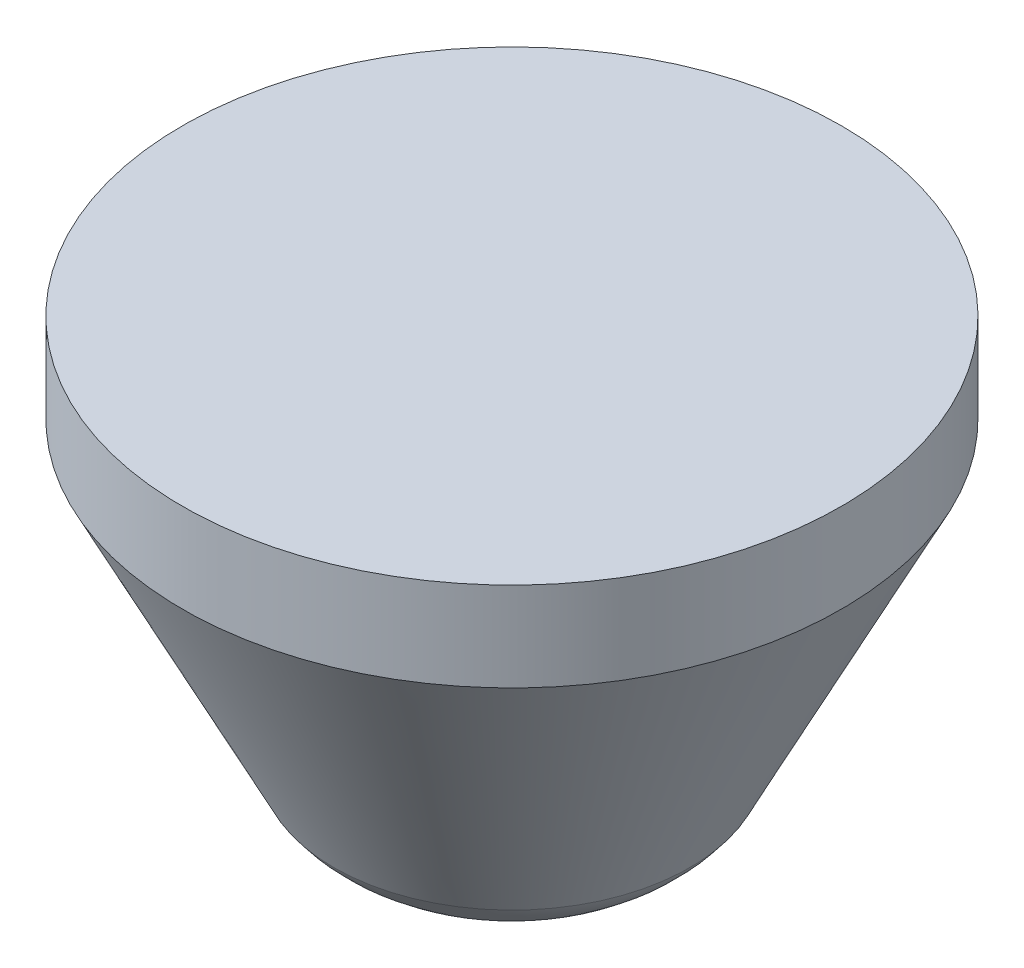
ISO-10303-21;
HEADER;
FILE_DESCRIPTION(('STEP AP214'),'2;1');
FILE_NAME('part.step','',(''),(''),'','','');
FILE_SCHEMA(('AUTOMOTIVE_DESIGN { 1 0 10303 214 1 1 1 1 }'));
ENDSEC;
DATA;
#1=APPLICATION_CONTEXT('core data for automotive mechanical design processes');
#2=APPLICATION_PROTOCOL_DEFINITION('international standard','automotive_design',2000,#1);
#3=PRODUCT_CONTEXT('',#1,'mechanical');
#4=PRODUCT('Part','Part','',(#3));
#5=PRODUCT_RELATED_PRODUCT_CATEGORY('part','',(#4));
#6=PRODUCT_DEFINITION_FORMATION('','',#4);
#7=PRODUCT_DEFINITION_CONTEXT('part definition',#1,'design');
#8=PRODUCT_DEFINITION('design','',#6,#7);
#9=PRODUCT_DEFINITION_SHAPE('','',#8);
#10=(LENGTH_UNIT() NAMED_UNIT(*) SI_UNIT(.MILLI.,.METRE.));
#11=(NAMED_UNIT(*) PLANE_ANGLE_UNIT() SI_UNIT($,.RADIAN.));
#12=(NAMED_UNIT(*) SI_UNIT($,.STERADIAN.) SOLID_ANGLE_UNIT());
#13=UNCERTAINTY_MEASURE_WITH_UNIT(LENGTH_MEASURE(1.E-05),#10,'distance_accuracy_value','');
#14=(GEOMETRIC_REPRESENTATION_CONTEXT(3) GLOBAL_UNCERTAINTY_ASSIGNED_CONTEXT((#13)) GLOBAL_UNIT_ASSIGNED_CONTEXT((#10,
#11,#12)) REPRESENTATION_CONTEXT('',''));
#15=CARTESIAN_POINT('',(0.,0.,0.));
#16=DIRECTION('',(0.,0.,1.));
#17=DIRECTION('',(1.,0.,0.));
#18=AXIS2_PLACEMENT_3D('',#15,#16,#17);
#19=CARTESIAN_POINT('',(1.54331945305403,0.,0.));
#20=DIRECTION('',(0.,-1.,0.));
#21=DIRECTION('',(0.,0.,-1.));
#22=AXIS2_PLACEMENT_3D('',#19,#20,#21);
#23=PLANE('',#22);
#24=CARTESIAN_POINT('',(0.,0.,0.));
#25=DIRECTION('',(0.,-1.,0.));
#26=DIRECTION('',(0.,0.,-1.));
#27=AXIS2_PLACEMENT_3D('',#24,#25,#26);
#28=CIRCLE('',#27,1.54331945305403);
#29=CARTESIAN_POINT('',(0.,0.,-1.54331945305403));
#30=VERTEX_POINT('',#29);
#31=EDGE_CURVE('E49',#30,#30,#28,.T.);
#32=ORIENTED_EDGE('',*,*,#31,.T.);
#33=EDGE_LOOP('',(#32));
#34=FACE_BOUND('',#33,.T.);
#35=ADVANCED_FACE('F35',(#34),#23,.T.);
#36=CARTESIAN_POINT('',(0.,10.,0.));
#37=DIRECTION('',(0.,1.,0.));
#38=DIRECTION('',(0.,0.,1.));
#39=AXIS2_PLACEMENT_3D('',#36,#37,#38);
#40=PLANE('',#39);
#41=CARTESIAN_POINT('',(0.,10.,0.));
#42=DIRECTION('',(0.,-1.,0.));
#43=DIRECTION('',(0.,0.,-1.));
#44=AXIS2_PLACEMENT_3D('',#41,#42,#43);
#45=CIRCLE('',#44,7.4);
#46=CARTESIAN_POINT('',(0.,10.,-7.4));
#47=VERTEX_POINT('',#46);
#48=EDGE_CURVE('E10',#47,#47,#45,.T.);
#49=ORIENTED_EDGE('',*,*,#48,.F.);
#50=EDGE_LOOP('',(#49));
#51=FACE_BOUND('',#50,.T.);
#52=ADVANCED_FACE('F67',(#51),#40,.T.);
#53=CARTESIAN_POINT('',(0.,0.,0.));
#54=DIRECTION('',(0.,-1.,0.));
#55=DIRECTION('',(0.,0.,-1.));
#56=AXIS2_PLACEMENT_3D('',#53,#54,#55);
#57=CYLINDRICAL_SURFACE('',#56,7.4);
#58=ORIENTED_EDGE('',*,*,#48,.T.);
#59=EDGE_LOOP('',(#58));
#60=FACE_BOUND('',#59,.T.);
#61=CARTESIAN_POINT('',(0.,8.,0.));
#62=DIRECTION('',(0.,-1.,0.));
#63=DIRECTION('',(0.,0.,-1.));
#64=AXIS2_PLACEMENT_3D('',#61,#62,#63);
#65=CIRCLE('',#64,7.4);
#66=CARTESIAN_POINT('',(0.,8.,-7.4));
#67=VERTEX_POINT('',#66);
#68=EDGE_CURVE('E41',#67,#67,#65,.T.);
#69=ORIENTED_EDGE('',*,*,#68,.F.);
#70=EDGE_LOOP('',(#69));
#71=FACE_BOUND('',#70,.T.);
#72=ADVANCED_FACE('F64',(#60,#71),#57,.T.);
#73=CARTESIAN_POINT('',(0.,1.27330944701672,0.));
#74=DIRECTION('',(0.,1.,0.));
#75=DIRECTION('',(0.,0.,1.));
#76=AXIS2_PLACEMENT_3D('',#73,#74,#75);
#77=CONICAL_SURFACE('',#76,3.99659068433652,0.468401033160418);
#78=ORIENTED_EDGE('',*,*,#68,.T.);
#79=EDGE_LOOP('',(#78));
#80=FACE_BOUND('',#79,.T.);
#81=CARTESIAN_POINT('',(0.,1.27330944701672,0.));
#82=DIRECTION('',(0.,-1.,0.));
#83=DIRECTION('',(0.,0.,-1.));
#84=AXIS2_PLACEMENT_3D('',#81,#82,#83);
#85=CIRCLE('',#84,3.99659068433652);
#86=CARTESIAN_POINT('',(0.,1.27330944701672,-3.99659068433652));
#87=VERTEX_POINT('',#86);
#88=EDGE_CURVE('E45',#87,#87,#85,.T.);
#89=ORIENTED_EDGE('',*,*,#88,.F.);
#90=EDGE_LOOP('',(#89));
#91=FACE_BOUND('',#90,.T.);
#92=ADVANCED_FACE('F58',(#80,#91),#77,.T.);
#93=CARTESIAN_POINT('',(0.,3.,0.));
#94=DIRECTION('',(0.,-1.,0.));
#95=DIRECTION('',(0.,0.,-1.));
#96=AXIS2_PLACEMENT_3D('',#93,#94,#95);
#97=DEGENERATE_TOROIDAL_SURFACE('',#96,1.54331945305403,3.,.T.);
#98=ORIENTED_EDGE('',*,*,#88,.T.);
#99=EDGE_LOOP('',(#98));
#100=FACE_BOUND('',#99,.T.);
#101=ORIENTED_EDGE('',*,*,#31,.F.);
#102=EDGE_LOOP('',(#101));
#103=FACE_BOUND('',#102,.T.);
#104=ADVANCED_FACE('F56',(#100,#103),#97,.T.);
#105=CLOSED_SHELL('',(#35,#52,#72,#92,#104));
#106=MANIFOLD_SOLID_BREP('B2',#105);
#107=ADVANCED_BREP_SHAPE_REPRESENTATION('',(#18,#106),#14);
#108=SHAPE_DEFINITION_REPRESENTATION(#9,#107);
ENDSEC;
END-ISO-10303-21;
